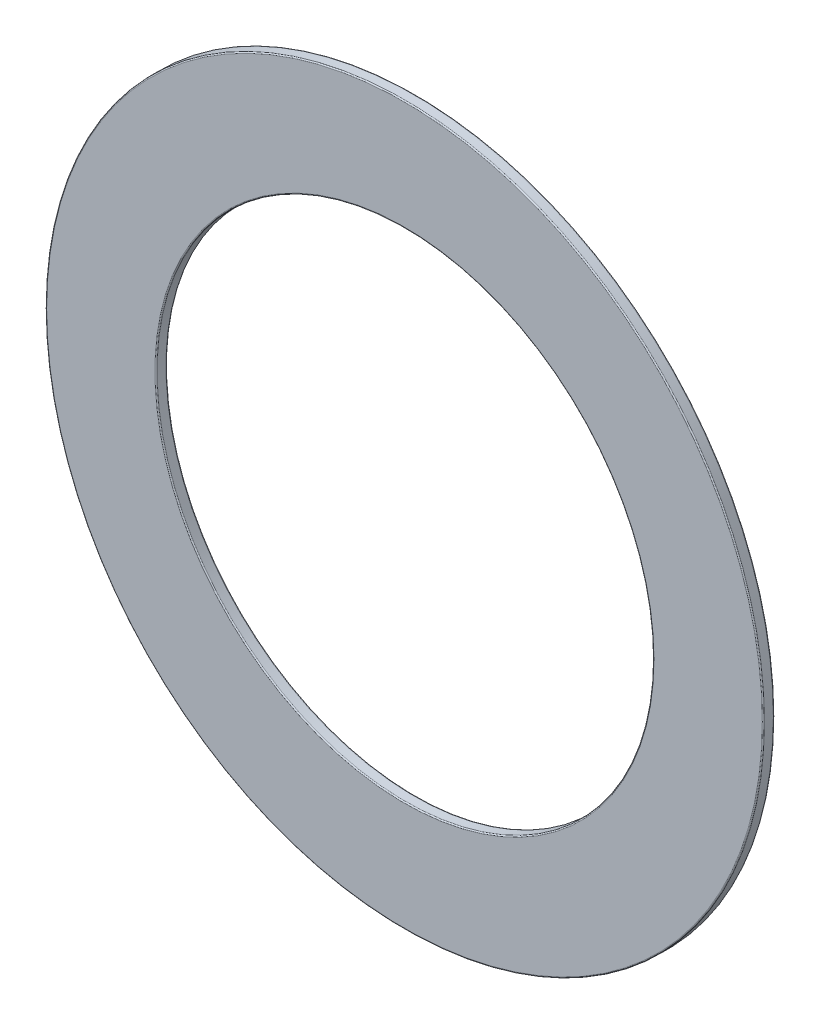
ISO-10303-21;
HEADER;
FILE_DESCRIPTION(('STEP AP214'),'2;1');
FILE_NAME('part.step','',(''),(''),'','','');
FILE_SCHEMA(('AUTOMOTIVE_DESIGN { 1 0 10303 214 1 1 1 1 }'));
ENDSEC;
DATA;
#1=APPLICATION_CONTEXT('core data for automotive mechanical design processes');
#2=APPLICATION_PROTOCOL_DEFINITION('international standard','automotive_design',2000,#1);
#3=PRODUCT_CONTEXT('',#1,'mechanical');
#4=PRODUCT('Part','Part','',(#3));
#5=PRODUCT_RELATED_PRODUCT_CATEGORY('part','',(#4));
#6=PRODUCT_DEFINITION_FORMATION('','',#4);
#7=PRODUCT_DEFINITION_CONTEXT('part definition',#1,'design');
#8=PRODUCT_DEFINITION('design','',#6,#7);
#9=PRODUCT_DEFINITION_SHAPE('','',#8);
#10=(LENGTH_UNIT() NAMED_UNIT(*) SI_UNIT(.MILLI.,.METRE.));
#11=(NAMED_UNIT(*) PLANE_ANGLE_UNIT() SI_UNIT($,.RADIAN.));
#12=(NAMED_UNIT(*) SI_UNIT($,.STERADIAN.) SOLID_ANGLE_UNIT());
#13=UNCERTAINTY_MEASURE_WITH_UNIT(LENGTH_MEASURE(1.E-05),#10,'distance_accuracy_value','');
#14=(GEOMETRIC_REPRESENTATION_CONTEXT(3) GLOBAL_UNCERTAINTY_ASSIGNED_CONTEXT((#13)) GLOBAL_UNIT_ASSIGNED_CONTEXT((#10,
#11,#12)) REPRESENTATION_CONTEXT('',''));
#15=CARTESIAN_POINT('',(0.,0.,0.));
#16=DIRECTION('',(0.,0.,1.));
#17=DIRECTION('',(1.,0.,0.));
#18=AXIS2_PLACEMENT_3D('',#15,#16,#17);
#19=CARTESIAN_POINT('',(0.,0.,0.1));
#20=DIRECTION('',(0.,0.,1.));
#21=DIRECTION('',(0.,-1.,0.));
#22=AXIS2_PLACEMENT_3D('',#19,#20,#21);
#23=TOROIDAL_SURFACE('',#22,32.4,0.1);
#24=CARTESIAN_POINT('',(0.,0.,0.));
#25=DIRECTION('',(0.,0.,1.));
#26=DIRECTION('',(1.,0.,0.));
#27=AXIS2_PLACEMENT_3D('',#24,#25,#26);
#28=CIRCLE('',#27,32.4);
#29=CARTESIAN_POINT('',(32.4,0.,0.));
#30=VERTEX_POINT('',#29);
#31=EDGE_CURVE('E11',#30,#30,#28,.T.);
#32=ORIENTED_EDGE('',*,*,#31,.T.);
#33=EDGE_LOOP('',(#32));
#34=FACE_BOUND('',#33,.T.);
#35=CARTESIAN_POINT('',(0.,0.,0.1));
#36=DIRECTION('',(0.,0.,-1.));
#37=DIRECTION('',(1.,0.,0.));
#38=AXIS2_PLACEMENT_3D('',#35,#36,#37);
#39=CIRCLE('',#38,32.5);
#40=CARTESIAN_POINT('',(32.5,0.,0.1));
#41=VERTEX_POINT('',#40);
#42=EDGE_CURVE('E79',#41,#41,#39,.T.);
#43=ORIENTED_EDGE('',*,*,#42,.T.);
#44=EDGE_LOOP('',(#43));
#45=FACE_BOUND('',#44,.T.);
#46=ADVANCED_FACE('F17',(#34,#45),#23,.T.);
#47=CARTESIAN_POINT('',(-27.5,0.,0.));
#48=DIRECTION('',(0.,0.,-1.));
#49=DIRECTION('',(0.,-1.,0.));
#50=AXIS2_PLACEMENT_3D('',#47,#48,#49);
#51=PLANE('',#50);
#52=CARTESIAN_POINT('',(0.,0.,0.));
#53=DIRECTION('',(0.,0.,-1.));
#54=DIRECTION('',(1.,0.,0.));
#55=AXIS2_PLACEMENT_3D('',#52,#53,#54);
#56=CIRCLE('',#55,22.6);
#57=CARTESIAN_POINT('',(22.6,0.,0.));
#58=VERTEX_POINT('',#57);
#59=EDGE_CURVE('E27',#58,#58,#56,.T.);
#60=ORIENTED_EDGE('',*,*,#59,.F.);
#61=EDGE_LOOP('',(#60));
#62=FACE_BOUND('',#61,.T.);
#63=ORIENTED_EDGE('',*,*,#31,.F.);
#64=EDGE_LOOP('',(#63));
#65=FACE_BOUND('',#64,.T.);
#66=ADVANCED_FACE('F133',(#62,#65),#51,.T.);
#67=CARTESIAN_POINT('',(0.,0.,0.1));
#68=DIRECTION('',(0.,0.,1.));
#69=DIRECTION('',(0.,-1.,0.));
#70=AXIS2_PLACEMENT_3D('',#67,#68,#69);
#71=TOROIDAL_SURFACE('',#70,22.6,0.1);
#72=CARTESIAN_POINT('',(0.,0.,0.1));
#73=DIRECTION('',(0.,0.,1.));
#74=DIRECTION('',(1.,0.,0.));
#75=AXIS2_PLACEMENT_3D('',#72,#73,#74);
#76=CIRCLE('',#75,22.5);
#77=CARTESIAN_POINT('',(22.5,0.,0.1));
#78=VERTEX_POINT('',#77);
#79=EDGE_CURVE('E87',#78,#78,#76,.T.);
#80=ORIENTED_EDGE('',*,*,#79,.T.);
#81=EDGE_LOOP('',(#80));
#82=FACE_BOUND('',#81,.T.);
#83=ORIENTED_EDGE('',*,*,#59,.T.);
#84=EDGE_LOOP('',(#83));
#85=FACE_BOUND('',#84,.T.);
#86=ADVANCED_FACE('F125',(#82,#85),#71,.T.);
#87=CARTESIAN_POINT('',(0.,0.,0.5));
#88=DIRECTION('',(0.,0.,1.));
#89=DIRECTION('',(-1.,0.,0.));
#90=AXIS2_PLACEMENT_3D('',#87,#88,#89);
#91=CYLINDRICAL_SURFACE('',#90,22.5);
#92=ORIENTED_EDGE('',*,*,#79,.F.);
#93=EDGE_LOOP('',(#92));
#94=FACE_BOUND('',#93,.T.);
#95=CARTESIAN_POINT('',(0.,0.,0.9));
#96=DIRECTION('',(0.,0.,-1.));
#97=DIRECTION('',(1.,0.,0.));
#98=AXIS2_PLACEMENT_3D('',#95,#96,#97);
#99=CIRCLE('',#98,22.5);
#100=CARTESIAN_POINT('',(22.5,0.,0.9));
#101=VERTEX_POINT('',#100);
#102=EDGE_CURVE('E74',#101,#101,#99,.T.);
#103=ORIENTED_EDGE('',*,*,#102,.F.);
#104=EDGE_LOOP('',(#103));
#105=FACE_BOUND('',#104,.T.);
#106=ADVANCED_FACE('F115',(#94,#105),#91,.F.);
#107=CARTESIAN_POINT('',(0.,0.,0.9));
#108=DIRECTION('',(0.,0.,1.));
#109=DIRECTION('',(0.,-1.,0.));
#110=AXIS2_PLACEMENT_3D('',#107,#108,#109);
#111=TOROIDAL_SURFACE('',#110,22.6,0.1);
#112=CARTESIAN_POINT('',(0.,0.,1.));
#113=DIRECTION('',(0.,0.,1.));
#114=DIRECTION('',(1.,0.,0.));
#115=AXIS2_PLACEMENT_3D('',#112,#113,#114);
#116=CIRCLE('',#115,22.6);
#117=CARTESIAN_POINT('',(22.6,0.,1.));
#118=VERTEX_POINT('',#117);
#119=EDGE_CURVE('E82',#118,#118,#116,.T.);
#120=ORIENTED_EDGE('',*,*,#119,.T.);
#121=EDGE_LOOP('',(#120));
#122=FACE_BOUND('',#121,.T.);
#123=ORIENTED_EDGE('',*,*,#102,.T.);
#124=EDGE_LOOP('',(#123));
#125=FACE_BOUND('',#124,.T.);
#126=ADVANCED_FACE('F110',(#122,#125),#111,.T.);
#127=CARTESIAN_POINT('',(0.,0.,0.5));
#128=DIRECTION('',(0.,0.,1.));
#129=DIRECTION('',(-1.,0.,0.));
#130=AXIS2_PLACEMENT_3D('',#127,#128,#129);
#131=CYLINDRICAL_SURFACE('',#130,32.5);
#132=ORIENTED_EDGE('',*,*,#42,.F.);
#133=EDGE_LOOP('',(#132));
#134=FACE_BOUND('',#133,.T.);
#135=CARTESIAN_POINT('',(0.,0.,0.9));
#136=DIRECTION('',(0.,0.,1.));
#137=DIRECTION('',(1.,0.,0.));
#138=AXIS2_PLACEMENT_3D('',#135,#136,#137);
#139=CIRCLE('',#138,32.5);
#140=CARTESIAN_POINT('',(32.5,0.,0.9));
#141=VERTEX_POINT('',#140);
#142=EDGE_CURVE('E21',#141,#141,#139,.T.);
#143=ORIENTED_EDGE('',*,*,#142,.F.);
#144=EDGE_LOOP('',(#143));
#145=FACE_BOUND('',#144,.T.);
#146=ADVANCED_FACE('F19',(#134,#145),#131,.T.);
#147=CARTESIAN_POINT('',(-27.5,0.,1.));
#148=DIRECTION('',(0.,0.,1.));
#149=DIRECTION('',(1.,0.,0.));
#150=AXIS2_PLACEMENT_3D('',#147,#148,#149);
#151=PLANE('',#150);
#152=ORIENTED_EDGE('',*,*,#119,.F.);
#153=EDGE_LOOP('',(#152));
#154=FACE_BOUND('',#153,.T.);
#155=CARTESIAN_POINT('',(0.,0.,1.));
#156=DIRECTION('',(0.,0.,-1.));
#157=DIRECTION('',(1.,0.,0.));
#158=AXIS2_PLACEMENT_3D('',#155,#156,#157);
#159=CIRCLE('',#158,32.4);
#160=CARTESIAN_POINT('',(32.4,0.,1.));
#161=VERTEX_POINT('',#160);
#162=EDGE_CURVE('E58',#161,#161,#159,.T.);
#163=ORIENTED_EDGE('',*,*,#162,.F.);
#164=EDGE_LOOP('',(#163));
#165=FACE_BOUND('',#164,.T.);
#166=ADVANCED_FACE('F103',(#154,#165),#151,.T.);
#167=CARTESIAN_POINT('',(0.,0.,0.9));
#168=DIRECTION('',(0.,0.,1.));
#169=DIRECTION('',(0.,-1.,0.));
#170=AXIS2_PLACEMENT_3D('',#167,#168,#169);
#171=TOROIDAL_SURFACE('',#170,32.4,0.1);
#172=ORIENTED_EDGE('',*,*,#142,.T.);
#173=EDGE_LOOP('',(#172));
#174=FACE_BOUND('',#173,.T.);
#175=ORIENTED_EDGE('',*,*,#162,.T.);
#176=EDGE_LOOP('',(#175));
#177=FACE_BOUND('',#176,.T.);
#178=ADVANCED_FACE('F98',(#174,#177),#171,.T.);
#179=CLOSED_SHELL('',(#46,#66,#86,#106,#126,#146,#166,#178));
#180=MANIFOLD_SOLID_BREP('B1',#179);
#181=ADVANCED_BREP_SHAPE_REPRESENTATION('',(#18,#180),#14);
#182=SHAPE_DEFINITION_REPRESENTATION(#9,#181);
ENDSEC;
END-ISO-10303-21;
